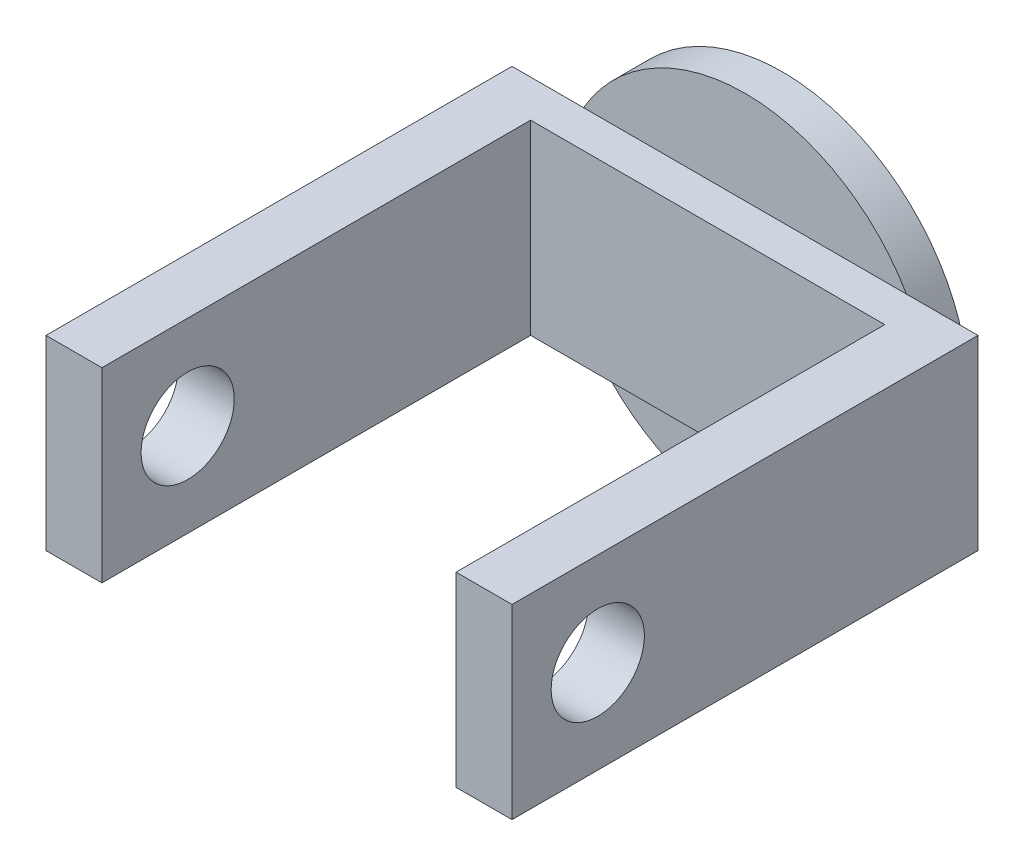
ISO-10303-21;
HEADER;
FILE_DESCRIPTION(('STEP AP214'),'2;1');
FILE_NAME('part.step','',(''),(''),'','','');
FILE_SCHEMA(('AUTOMOTIVE_DESIGN { 1 0 10303 214 1 1 1 1 }'));
ENDSEC;
DATA;
#1=APPLICATION_CONTEXT('core data for automotive mechanical design processes');
#2=APPLICATION_PROTOCOL_DEFINITION('international standard','automotive_design',2000,#1);
#3=PRODUCT_CONTEXT('',#1,'mechanical');
#4=PRODUCT('Part','Part','',(#3));
#5=PRODUCT_RELATED_PRODUCT_CATEGORY('part','',(#4));
#6=PRODUCT_DEFINITION_FORMATION('','',#4);
#7=PRODUCT_DEFINITION_CONTEXT('part definition',#1,'design');
#8=PRODUCT_DEFINITION('design','',#6,#7);
#9=PRODUCT_DEFINITION_SHAPE('','',#8);
#10=(LENGTH_UNIT() NAMED_UNIT(*) SI_UNIT(.MILLI.,.METRE.));
#11=(NAMED_UNIT(*) PLANE_ANGLE_UNIT() SI_UNIT($,.RADIAN.));
#12=(NAMED_UNIT(*) SI_UNIT($,.STERADIAN.) SOLID_ANGLE_UNIT());
#13=UNCERTAINTY_MEASURE_WITH_UNIT(LENGTH_MEASURE(1.E-05),#10,'distance_accuracy_value','');
#14=(GEOMETRIC_REPRESENTATION_CONTEXT(3) GLOBAL_UNCERTAINTY_ASSIGNED_CONTEXT((#13)) GLOBAL_UNIT_ASSIGNED_CONTEXT((#10,
#11,#12)) REPRESENTATION_CONTEXT('',''));
#15=CARTESIAN_POINT('',(0.,0.,0.));
#16=DIRECTION('',(0.,0.,1.));
#17=DIRECTION('',(1.,0.,0.));
#18=AXIS2_PLACEMENT_3D('',#15,#16,#17);
#19=CARTESIAN_POINT('',(0.,0.,20.));
#20=DIRECTION('',(0.,0.,-1.));
#21=DIRECTION('',(-1.,0.,0.));
#22=AXIS2_PLACEMENT_3D('',#19,#20,#21);
#23=PLANE('',#22);
#24=DIRECTION('',(0.,1.,0.));
#25=VECTOR('',#24,1.);
#26=CARTESIAN_POINT('',(-47.5,25.,20.));
#27=LINE('',#26,#25);
#28=CARTESIAN_POINT('',(-47.5,-25.,20.));
#29=VERTEX_POINT('',#28);
#30=CARTESIAN_POINT('',(-47.5,25.,20.));
#31=VERTEX_POINT('',#30);
#32=EDGE_CURVE('E70',#29,#31,#27,.T.);
#33=ORIENTED_EDGE('',*,*,#32,.F.);
#34=DIRECTION('',(1.,0.,0.));
#35=VECTOR('',#34,1.);
#36=CARTESIAN_POINT('',(-62.5,-25.,20.));
#37=LINE('',#36,#35);
#38=CARTESIAN_POINT('',(47.5,-25.,20.));
#39=VERTEX_POINT('',#38);
#40=EDGE_CURVE('E197',#29,#39,#37,.T.);
#41=ORIENTED_EDGE('',*,*,#40,.T.);
#42=DIRECTION('',(0.,-1.,0.));
#43=VECTOR('',#42,1.);
#44=CARTESIAN_POINT('',(47.5,25.,20.));
#45=LINE('',#44,#43);
#46=CARTESIAN_POINT('',(47.5,25.,20.));
#47=VERTEX_POINT('',#46);
#48=EDGE_CURVE('E65',#47,#39,#45,.T.);
#49=ORIENTED_EDGE('',*,*,#48,.F.);
#50=DIRECTION('',(-1.,0.,0.));
#51=VECTOR('',#50,1.);
#52=CARTESIAN_POINT('',(-62.5,25.,20.));
#53=LINE('',#52,#51);
#54=EDGE_CURVE('E200',#47,#31,#53,.T.);
#55=ORIENTED_EDGE('',*,*,#54,.T.);
#56=EDGE_LOOP('',(#33,#41,#49,#55));
#57=FACE_BOUND('',#56,.T.);
#58=ADVANCED_FACE('F45',(#57),#23,.F.);
#59=CARTESIAN_POINT('',(0.,0.,10.));
#60=DIRECTION('',(0.,0.,1.));
#61=DIRECTION('',(1.,0.,0.));
#62=AXIS2_PLACEMENT_3D('',#59,#60,#61);
#63=PLANE('',#62);
#64=DIRECTION('',(-1.,0.,0.));
#65=VECTOR('',#64,1.);
#66=CARTESIAN_POINT('',(-62.5,25.,10.));
#67=LINE('',#66,#65);
#68=CARTESIAN_POINT('',(43.3012701892219,25.,10.));
#69=VERTEX_POINT('',#68);
#70=CARTESIAN_POINT('',(-43.3012701892219,25.,10.));
#71=VERTEX_POINT('',#70);
#72=EDGE_CURVE('E11',#69,#71,#67,.T.);
#73=ORIENTED_EDGE('',*,*,#72,.F.);
#74=CARTESIAN_POINT('',(0.,0.,10.));
#75=DIRECTION('',(0.,0.,1.));
#76=DIRECTION('',(1.,0.,0.));
#77=AXIS2_PLACEMENT_3D('',#74,#75,#76);
#78=CIRCLE('',#77,50.);
#79=EDGE_CURVE('E224',#69,#71,#78,.T.);
#80=ORIENTED_EDGE('',*,*,#79,.T.);
#81=EDGE_LOOP('',(#73,#80));
#82=FACE_BOUND('',#81,.T.);
#83=ADVANCED_FACE('F257',(#82),#63,.T.);
#84=CARTESIAN_POINT('',(0.,0.,10.));
#85=DIRECTION('',(0.,0.,-1.));
#86=DIRECTION('',(-1.,0.,0.));
#87=AXIS2_PLACEMENT_3D('',#84,#85,#86);
#88=CYLINDRICAL_SURFACE('',#87,50.);
#89=ORIENTED_EDGE('',*,*,#79,.F.);
#90=CARTESIAN_POINT('',(43.3012701892219,-25.,10.));
#91=VERTEX_POINT('',#90);
#92=EDGE_CURVE('E228',#91,#69,#78,.T.);
#93=ORIENTED_EDGE('',*,*,#92,.F.);
#94=CARTESIAN_POINT('',(-43.3012701892219,-25.,10.));
#95=VERTEX_POINT('',#94);
#96=EDGE_CURVE('E235',#95,#91,#78,.T.);
#97=ORIENTED_EDGE('',*,*,#96,.F.);
#98=EDGE_CURVE('E227',#71,#95,#78,.T.);
#99=ORIENTED_EDGE('',*,*,#98,.F.);
#100=EDGE_LOOP('',(#89,#93,#97,#99));
#101=FACE_BOUND('',#100,.T.);
#102=CARTESIAN_POINT('',(0.,0.,0.));
#103=DIRECTION('',(0.,0.,1.));
#104=DIRECTION('',(1.,0.,0.));
#105=AXIS2_PLACEMENT_3D('',#102,#103,#104);
#106=CIRCLE('',#105,50.);
#107=CARTESIAN_POINT('',(50.,0.,0.));
#108=VERTEX_POINT('',#107);
#109=EDGE_CURVE('E138',#108,#108,#106,.T.);
#110=ORIENTED_EDGE('',*,*,#109,.T.);
#111=EDGE_LOOP('',(#110));
#112=FACE_BOUND('',#111,.T.);
#113=ADVANCED_FACE('F47',(#101,#112),#88,.T.);
#114=DIRECTION('',(1.,0.,0.));
#115=VECTOR('',#114,1.);
#116=CARTESIAN_POINT('',(-62.5,-25.,10.));
#117=LINE('',#116,#115);
#118=EDGE_CURVE('E55',#95,#91,#117,.T.);
#119=ORIENTED_EDGE('',*,*,#118,.F.);
#120=ORIENTED_EDGE('',*,*,#96,.T.);
#121=EDGE_LOOP('',(#119,#120));
#122=FACE_BOUND('',#121,.T.);
#123=ADVANCED_FACE('F293',(#122),#63,.T.);
#124=CARTESIAN_POINT('',(0.,0.,0.));
#125=DIRECTION('',(0.,0.,1.));
#126=DIRECTION('',(1.,0.,0.));
#127=AXIS2_PLACEMENT_3D('',#124,#125,#126);
#128=PLANE('',#127);
#129=ORIENTED_EDGE('',*,*,#109,.F.);
#130=EDGE_LOOP('',(#129));
#131=FACE_BOUND('',#130,.T.);
#132=ADVANCED_FACE('F303',(#131),#128,.F.);
#133=CARTESIAN_POINT('',(0.,0.,10.));
#134=DIRECTION('',(0.,0.,-1.));
#135=DIRECTION('',(-1.,0.,0.));
#136=AXIS2_PLACEMENT_3D('',#133,#134,#135);
#137=PLANE('',#136);
#138=CARTESIAN_POINT('',(-62.5,25.,10.));
#139=VERTEX_POINT('',#138);
#140=EDGE_CURVE('E58',#71,#139,#67,.T.);
#141=ORIENTED_EDGE('',*,*,#140,.F.);
#142=ORIENTED_EDGE('',*,*,#98,.T.);
#143=CARTESIAN_POINT('',(-62.5,-25.,10.));
#144=VERTEX_POINT('',#143);
#145=EDGE_CURVE('E207',#144,#95,#117,.T.);
#146=ORIENTED_EDGE('',*,*,#145,.F.);
#147=DIRECTION('',(0.,-1.,0.));
#148=VECTOR('',#147,1.);
#149=CARTESIAN_POINT('',(-62.5,-25.,10.));
#150=LINE('',#149,#148);
#151=EDGE_CURVE('E134',#139,#144,#150,.T.);
#152=ORIENTED_EDGE('',*,*,#151,.F.);
#153=EDGE_LOOP('',(#141,#142,#146,#152));
#154=FACE_BOUND('',#153,.T.);
#155=ADVANCED_FACE('F247',(#154),#137,.T.);
#156=CARTESIAN_POINT('',(-62.5,-25.,20.));
#157=DIRECTION('',(1.,0.,0.));
#158=DIRECTION('',(0.,0.,-1.));
#159=AXIS2_PLACEMENT_3D('',#156,#157,#158);
#160=PLANE('',#159);
#161=CARTESIAN_POINT('',(-62.5,0.,112.));
#162=DIRECTION('',(-1.,0.,0.));
#163=DIRECTION('',(0.,0.,1.));
#164=AXIS2_PLACEMENT_3D('',#161,#162,#163);
#165=CIRCLE('',#164,12.5);
#166=CARTESIAN_POINT('',(-62.5,0.,124.5));
#167=VERTEX_POINT('',#166);
#168=EDGE_CURVE('E420',#167,#167,#165,.T.);
#169=ORIENTED_EDGE('',*,*,#168,.F.);
#170=EDGE_LOOP('',(#169));
#171=FACE_BOUND('',#170,.T.);
#172=ORIENTED_EDGE('',*,*,#151,.T.);
#173=DIRECTION('',(0.,0.,-1.));
#174=VECTOR('',#173,1.);
#175=CARTESIAN_POINT('',(-62.5,-25.,20.));
#176=LINE('',#175,#174);
#177=CARTESIAN_POINT('',(-62.5,-25.,135.));
#178=VERTEX_POINT('',#177);
#179=EDGE_CURVE('E127',#178,#144,#176,.T.);
#180=ORIENTED_EDGE('',*,*,#179,.F.);
#181=DIRECTION('',(0.,-1.,0.));
#182=VECTOR('',#181,1.);
#183=CARTESIAN_POINT('',(-62.5,25.,135.));
#184=LINE('',#183,#182);
#185=CARTESIAN_POINT('',(-62.5,25.,135.));
#186=VERTEX_POINT('',#185);
#187=EDGE_CURVE('E132',#186,#178,#184,.T.);
#188=ORIENTED_EDGE('',*,*,#187,.F.);
#189=DIRECTION('',(0.,0.,-1.));
#190=VECTOR('',#189,1.);
#191=CARTESIAN_POINT('',(-62.5,25.,20.));
#192=LINE('',#191,#190);
#193=EDGE_CURVE('E203',#186,#139,#192,.T.);
#194=ORIENTED_EDGE('',*,*,#193,.T.);
#195=EDGE_LOOP('',(#172,#180,#188,#194));
#196=FACE_BOUND('',#195,.T.);
#197=ADVANCED_FACE('F129',(#171,#196),#160,.F.);
#198=CARTESIAN_POINT('',(-62.5,-25.,20.));
#199=DIRECTION('',(0.,1.,0.));
#200=DIRECTION('',(0.,0.,1.));
#201=AXIS2_PLACEMENT_3D('',#198,#199,#200);
#202=PLANE('',#201);
#203=ORIENTED_EDGE('',*,*,#145,.T.);
#204=ORIENTED_EDGE('',*,*,#118,.T.);
#205=CARTESIAN_POINT('',(62.5,-25.,10.));
#206=VERTEX_POINT('',#205);
#207=EDGE_CURVE('E206',#91,#206,#117,.T.);
#208=ORIENTED_EDGE('',*,*,#207,.T.);
#209=DIRECTION('',(0.,0.,-1.));
#210=VECTOR('',#209,1.);
#211=CARTESIAN_POINT('',(62.5,-25.,20.));
#212=LINE('',#211,#210);
#213=CARTESIAN_POINT('',(62.5,-25.,135.));
#214=VERTEX_POINT('',#213);
#215=EDGE_CURVE('E139',#214,#206,#212,.T.);
#216=ORIENTED_EDGE('',*,*,#215,.F.);
#217=DIRECTION('',(1.,0.,0.));
#218=VECTOR('',#217,1.);
#219=CARTESIAN_POINT('',(62.5,-25.,135.));
#220=LINE('',#219,#218);
#221=CARTESIAN_POINT('',(47.5,-25.,135.));
#222=VERTEX_POINT('',#221);
#223=EDGE_CURVE('E181',#222,#214,#220,.T.);
#224=ORIENTED_EDGE('',*,*,#223,.F.);
#225=DIRECTION('',(0.,0.,-1.));
#226=VECTOR('',#225,1.);
#227=CARTESIAN_POINT('',(47.5,-25.,135.));
#228=LINE('',#227,#226);
#229=EDGE_CURVE('E177',#222,#39,#228,.T.);
#230=ORIENTED_EDGE('',*,*,#229,.T.);
#231=ORIENTED_EDGE('',*,*,#40,.F.);
#232=DIRECTION('',(0.,0.,-1.));
#233=VECTOR('',#232,1.);
#234=CARTESIAN_POINT('',(-47.5,-25.,135.));
#235=LINE('',#234,#233);
#236=CARTESIAN_POINT('',(-47.5,-25.,135.));
#237=VERTEX_POINT('',#236);
#238=EDGE_CURVE('E145',#237,#29,#235,.T.);
#239=ORIENTED_EDGE('',*,*,#238,.F.);
#240=DIRECTION('',(1.,0.,0.));
#241=VECTOR('',#240,1.);
#242=CARTESIAN_POINT('',(-62.5,-25.,135.));
#243=LINE('',#242,#241);
#244=EDGE_CURVE('E142',#178,#237,#243,.T.);
#245=ORIENTED_EDGE('',*,*,#244,.F.);
#246=ORIENTED_EDGE('',*,*,#179,.T.);
#247=EDGE_LOOP('',(#203,#204,#208,#216,#224,#230,#231,#239,#245,#246));
#248=FACE_BOUND('',#247,.T.);
#249=ADVANCED_FACE('F143',(#248),#202,.F.);
#250=CARTESIAN_POINT('',(62.5,-25.,20.));
#251=DIRECTION('',(-1.,0.,0.));
#252=DIRECTION('',(0.,0.,1.));
#253=AXIS2_PLACEMENT_3D('',#250,#251,#252);
#254=PLANE('',#253);
#255=CARTESIAN_POINT('',(62.5,0.,112.));
#256=DIRECTION('',(-1.,0.,0.));
#257=DIRECTION('',(0.,0.,1.));
#258=AXIS2_PLACEMENT_3D('',#255,#256,#257);
#259=CIRCLE('',#258,12.5);
#260=CARTESIAN_POINT('',(62.5,0.,124.5));
#261=VERTEX_POINT('',#260);
#262=EDGE_CURVE('E413',#261,#261,#259,.T.);
#263=ORIENTED_EDGE('',*,*,#262,.T.);
#264=EDGE_LOOP('',(#263));
#265=FACE_BOUND('',#264,.T.);
#266=DIRECTION('',(0.,1.,0.));
#267=VECTOR('',#266,1.);
#268=CARTESIAN_POINT('',(62.5,-25.,10.));
#269=LINE('',#268,#267);
#270=CARTESIAN_POINT('',(62.5,25.,10.));
#271=VERTEX_POINT('',#270);
#272=EDGE_CURVE('E210',#206,#271,#269,.T.);
#273=ORIENTED_EDGE('',*,*,#272,.T.);
#274=DIRECTION('',(0.,0.,-1.));
#275=VECTOR('',#274,1.);
#276=CARTESIAN_POINT('',(62.5,25.,20.));
#277=LINE('',#276,#275);
#278=CARTESIAN_POINT('',(62.5,25.,135.));
#279=VERTEX_POINT('',#278);
#280=EDGE_CURVE('E217',#279,#271,#277,.T.);
#281=ORIENTED_EDGE('',*,*,#280,.F.);
#282=DIRECTION('',(0.,1.,0.));
#283=VECTOR('',#282,1.);
#284=CARTESIAN_POINT('',(62.5,25.,135.));
#285=LINE('',#284,#283);
#286=EDGE_CURVE('E184',#214,#279,#285,.T.);
#287=ORIENTED_EDGE('',*,*,#286,.F.);
#288=ORIENTED_EDGE('',*,*,#215,.T.);
#289=EDGE_LOOP('',(#273,#281,#287,#288));
#290=FACE_BOUND('',#289,.T.);
#291=ADVANCED_FACE('F261',(#265,#290),#254,.F.);
#292=CARTESIAN_POINT('',(-62.5,25.,20.));
#293=DIRECTION('',(0.,-1.,0.));
#294=DIRECTION('',(0.,0.,-1.));
#295=AXIS2_PLACEMENT_3D('',#292,#293,#294);
#296=PLANE('',#295);
#297=EDGE_CURVE('E57',#271,#69,#67,.T.);
#298=ORIENTED_EDGE('',*,*,#297,.T.);
#299=ORIENTED_EDGE('',*,*,#72,.T.);
#300=ORIENTED_EDGE('',*,*,#140,.T.);
#301=ORIENTED_EDGE('',*,*,#193,.F.);
#302=DIRECTION('',(-1.,0.,0.));
#303=VECTOR('',#302,1.);
#304=CARTESIAN_POINT('',(-62.5,25.,135.));
#305=LINE('',#304,#303);
#306=CARTESIAN_POINT('',(-47.5,25.,135.));
#307=VERTEX_POINT('',#306);
#308=EDGE_CURVE('E154',#307,#186,#305,.T.);
#309=ORIENTED_EDGE('',*,*,#308,.F.);
#310=DIRECTION('',(0.,0.,-1.));
#311=VECTOR('',#310,1.);
#312=CARTESIAN_POINT('',(-47.5,25.,135.));
#313=LINE('',#312,#311);
#314=EDGE_CURVE('E166',#307,#31,#313,.T.);
#315=ORIENTED_EDGE('',*,*,#314,.T.);
#316=ORIENTED_EDGE('',*,*,#54,.F.);
#317=DIRECTION('',(0.,0.,-1.));
#318=VECTOR('',#317,1.);
#319=CARTESIAN_POINT('',(47.5,25.,135.));
#320=LINE('',#319,#318);
#321=CARTESIAN_POINT('',(47.5,25.,135.));
#322=VERTEX_POINT('',#321);
#323=EDGE_CURVE('E173',#322,#47,#320,.T.);
#324=ORIENTED_EDGE('',*,*,#323,.F.);
#325=DIRECTION('',(-1.,0.,0.));
#326=VECTOR('',#325,1.);
#327=CARTESIAN_POINT('',(62.5,25.,135.));
#328=LINE('',#327,#326);
#329=EDGE_CURVE('E191',#279,#322,#328,.T.);
#330=ORIENTED_EDGE('',*,*,#329,.F.);
#331=ORIENTED_EDGE('',*,*,#280,.T.);
#332=EDGE_LOOP('',(#298,#299,#300,#301,#309,#315,#316,#324,#330,#331));
#333=FACE_BOUND('',#332,.T.);
#334=ADVANCED_FACE('F255',(#333),#296,.F.);
#335=ORIENTED_EDGE('',*,*,#207,.F.);
#336=ORIENTED_EDGE('',*,*,#92,.T.);
#337=ORIENTED_EDGE('',*,*,#297,.F.);
#338=ORIENTED_EDGE('',*,*,#272,.F.);
#339=EDGE_LOOP('',(#335,#336,#337,#338));
#340=FACE_BOUND('',#339,.T.);
#341=ADVANCED_FACE('F259',(#340),#137,.T.);
#342=CARTESIAN_POINT('',(47.5,25.,135.));
#343=DIRECTION('',(1.,0.,0.));
#344=DIRECTION('',(0.,0.,-1.));
#345=AXIS2_PLACEMENT_3D('',#342,#343,#344);
#346=PLANE('',#345);
#347=CARTESIAN_POINT('',(47.5,0.,112.));
#348=DIRECTION('',(1.,0.,0.));
#349=DIRECTION('',(0.,0.,-1.));
#350=AXIS2_PLACEMENT_3D('',#347,#348,#349);
#351=CIRCLE('',#350,12.5);
#352=CARTESIAN_POINT('',(47.5,0.,99.5));
#353=VERTEX_POINT('',#352);
#354=EDGE_CURVE('E160',#353,#353,#351,.T.);
#355=ORIENTED_EDGE('',*,*,#354,.T.);
#356=EDGE_LOOP('',(#355));
#357=FACE_BOUND('',#356,.T.);
#358=ORIENTED_EDGE('',*,*,#48,.T.);
#359=ORIENTED_EDGE('',*,*,#229,.F.);
#360=DIRECTION('',(0.,-1.,0.));
#361=VECTOR('',#360,1.);
#362=CARTESIAN_POINT('',(47.5,25.,135.));
#363=LINE('',#362,#361);
#364=EDGE_CURVE('E188',#322,#222,#363,.T.);
#365=ORIENTED_EDGE('',*,*,#364,.F.);
#366=ORIENTED_EDGE('',*,*,#323,.T.);
#367=EDGE_LOOP('',(#358,#359,#365,#366));
#368=FACE_BOUND('',#367,.T.);
#369=ADVANCED_FACE('F271',(#357,#368),#346,.F.);
#370=CARTESIAN_POINT('',(0.,0.,135.));
#371=DIRECTION('',(0.,0.,-1.));
#372=DIRECTION('',(-1.,0.,0.));
#373=AXIS2_PLACEMENT_3D('',#370,#371,#372);
#374=PLANE('',#373);
#375=ORIENTED_EDGE('',*,*,#286,.T.);
#376=ORIENTED_EDGE('',*,*,#329,.T.);
#377=ORIENTED_EDGE('',*,*,#364,.T.);
#378=ORIENTED_EDGE('',*,*,#223,.T.);
#379=EDGE_LOOP('',(#375,#376,#377,#378));
#380=FACE_BOUND('',#379,.T.);
#381=ADVANCED_FACE('F267',(#380),#374,.F.);
#382=CARTESIAN_POINT('',(-47.5,25.,135.));
#383=DIRECTION('',(-1.,0.,0.));
#384=DIRECTION('',(0.,0.,1.));
#385=AXIS2_PLACEMENT_3D('',#382,#383,#384);
#386=PLANE('',#385);
#387=CARTESIAN_POINT('',(-47.5,0.,112.));
#388=DIRECTION('',(-1.,0.,0.));
#389=DIRECTION('',(0.,0.,1.));
#390=AXIS2_PLACEMENT_3D('',#387,#388,#389);
#391=CIRCLE('',#390,12.5);
#392=CARTESIAN_POINT('',(-47.5,0.,124.5));
#393=VERTEX_POINT('',#392);
#394=EDGE_CURVE('E49',#393,#393,#391,.T.);
#395=ORIENTED_EDGE('',*,*,#394,.T.);
#396=EDGE_LOOP('',(#395));
#397=FACE_BOUND('',#396,.T.);
#398=ORIENTED_EDGE('',*,*,#32,.T.);
#399=ORIENTED_EDGE('',*,*,#314,.F.);
#400=DIRECTION('',(0.,1.,0.));
#401=VECTOR('',#400,1.);
#402=CARTESIAN_POINT('',(-47.5,25.,135.));
#403=LINE('',#402,#401);
#404=EDGE_CURVE('E149',#237,#307,#403,.T.);
#405=ORIENTED_EDGE('',*,*,#404,.F.);
#406=ORIENTED_EDGE('',*,*,#238,.T.);
#407=EDGE_LOOP('',(#398,#399,#405,#406));
#408=FACE_BOUND('',#407,.T.);
#409=ADVANCED_FACE('F280',(#397,#408),#386,.F.);
#410=CARTESIAN_POINT('',(0.,0.,135.));
#411=DIRECTION('',(0.,0.,1.));
#412=DIRECTION('',(1.,0.,0.));
#413=AXIS2_PLACEMENT_3D('',#410,#411,#412);
#414=PLANE('',#413);
#415=ORIENTED_EDGE('',*,*,#187,.T.);
#416=ORIENTED_EDGE('',*,*,#244,.T.);
#417=ORIENTED_EDGE('',*,*,#404,.T.);
#418=ORIENTED_EDGE('',*,*,#308,.T.);
#419=EDGE_LOOP('',(#415,#416,#417,#418));
#420=FACE_BOUND('',#419,.T.);
#421=ADVANCED_FACE('F152',(#420),#414,.T.);
#422=CARTESIAN_POINT('',(62.5,0.,112.));
#423=DIRECTION('',(-1.,0.,0.));
#424=DIRECTION('',(0.,0.,1.));
#425=AXIS2_PLACEMENT_3D('',#422,#423,#424);
#426=CYLINDRICAL_SURFACE('',#425,12.5);
#427=ORIENTED_EDGE('',*,*,#168,.T.);
#428=EDGE_LOOP('',(#427));
#429=FACE_BOUND('',#428,.T.);
#430=ORIENTED_EDGE('',*,*,#394,.F.);
#431=EDGE_LOOP('',(#430));
#432=FACE_BOUND('',#431,.T.);
#433=ADVANCED_FACE('F390',(#429,#432),#426,.F.);
#434=ORIENTED_EDGE('',*,*,#262,.F.);
#435=EDGE_LOOP('',(#434));
#436=FACE_BOUND('',#435,.T.);
#437=ORIENTED_EDGE('',*,*,#354,.F.);
#438=EDGE_LOOP('',(#437));
#439=FACE_BOUND('',#438,.T.);
#440=ADVANCED_FACE('F398',(#436,#439),#426,.F.);
#441=CLOSED_SHELL('',(#58,#83,#113,#123,#132,#155,#197,#249,#291,#334,#341,#369,#381,#409,#421,
#433,#440));
#442=MANIFOLD_SOLID_BREP('B2',#441);
#443=ADVANCED_BREP_SHAPE_REPRESENTATION('',(#18,#442),#14);
#444=SHAPE_DEFINITION_REPRESENTATION(#9,#443);
ENDSEC;
END-ISO-10303-21;
